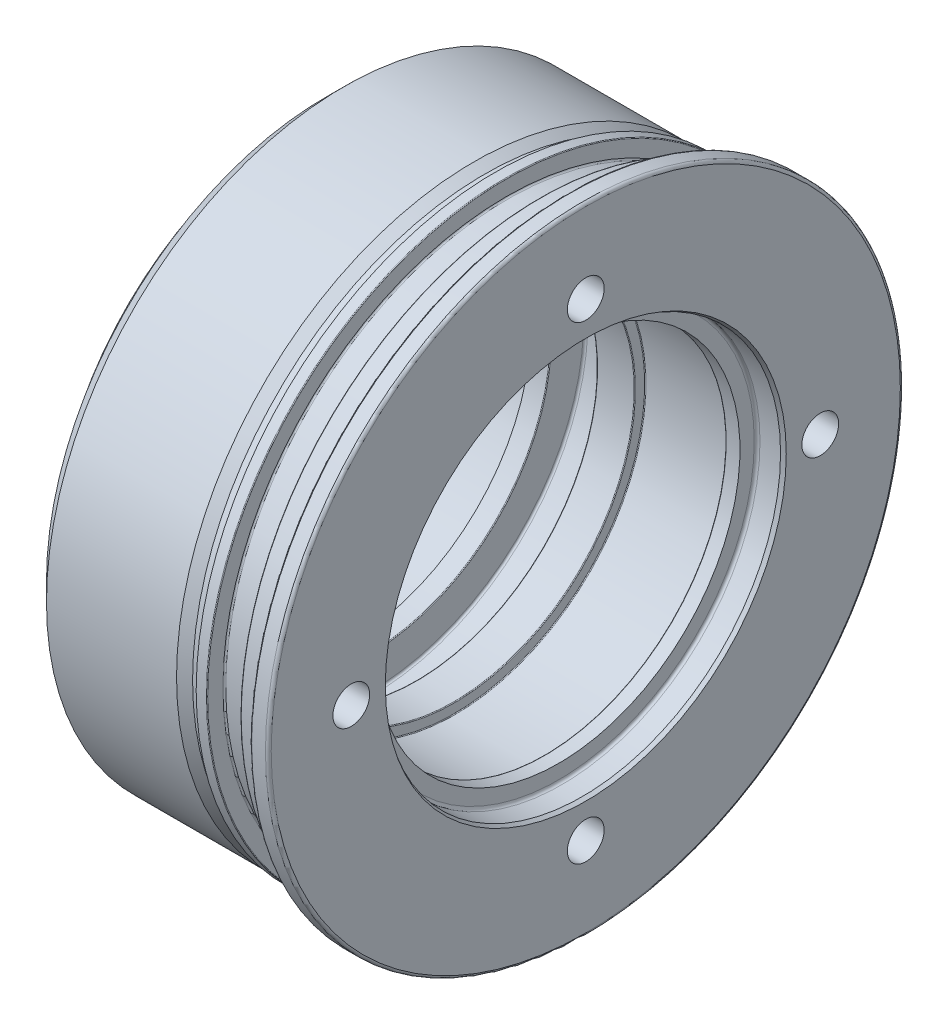
ISO-10303-21;
HEADER;
FILE_DESCRIPTION(('STEP AP214'),'2;1');
FILE_NAME('part.step','',(''),(''),'','','');
FILE_SCHEMA(('AUTOMOTIVE_DESIGN { 1 0 10303 214 1 1 1 1 }'));
ENDSEC;
DATA;
#1=APPLICATION_CONTEXT('core data for automotive mechanical design processes');
#2=APPLICATION_PROTOCOL_DEFINITION('international standard','automotive_design',2000,#1);
#3=PRODUCT_CONTEXT('',#1,'mechanical');
#4=PRODUCT('Part','Part','',(#3));
#5=PRODUCT_RELATED_PRODUCT_CATEGORY('part','',(#4));
#6=PRODUCT_DEFINITION_FORMATION('','',#4);
#7=PRODUCT_DEFINITION_CONTEXT('part definition',#1,'design');
#8=PRODUCT_DEFINITION('design','',#6,#7);
#9=PRODUCT_DEFINITION_SHAPE('','',#8);
#10=(LENGTH_UNIT() NAMED_UNIT(*) SI_UNIT(.MILLI.,.METRE.));
#11=(NAMED_UNIT(*) PLANE_ANGLE_UNIT() SI_UNIT($,.RADIAN.));
#12=(NAMED_UNIT(*) SI_UNIT($,.STERADIAN.) SOLID_ANGLE_UNIT());
#13=UNCERTAINTY_MEASURE_WITH_UNIT(LENGTH_MEASURE(1.E-05),#10,'distance_accuracy_value','');
#14=(GEOMETRIC_REPRESENTATION_CONTEXT(3) GLOBAL_UNCERTAINTY_ASSIGNED_CONTEXT((#13)) GLOBAL_UNIT_ASSIGNED_CONTEXT((#10,
#11,#12)) REPRESENTATION_CONTEXT('',''));
#15=CARTESIAN_POINT('',(0.,0.,0.));
#16=DIRECTION('',(0.,0.,1.));
#17=DIRECTION('',(1.,0.,0.));
#18=AXIS2_PLACEMENT_3D('',#15,#16,#17);
#19=CARTESIAN_POINT('',(-77.4999999999995,0.,0.));
#20=DIRECTION('',(-1.,0.,0.));
#21=DIRECTION('',(0.,0.,0.999999999999999));
#22=AXIS2_PLACEMENT_3D('',#19,#20,#21);
#23=CYLINDRICAL_SURFACE('',#22,81.);
#24=CARTESIAN_POINT('',(-27.9999999999994,-1.11022302462516E-13,-1.66533453693773E-13));
#25=DIRECTION('',(-1.,0.,0.));
#26=DIRECTION('',(0.,0.,0.999999999999999));
#27=AXIS2_PLACEMENT_3D('',#24,#25,#26);
#28=CIRCLE('',#27,81.);
#29=CARTESIAN_POINT('',(-27.9999999999994,-1.11022302462516E-13,80.9999999999998));
#30=VERTEX_POINT('',#29);
#31=EDGE_CURVE('E11',#30,#30,#28,.T.);
#32=ORIENTED_EDGE('',*,*,#31,.F.);
#33=EDGE_LOOP('',(#32));
#34=FACE_BOUND('',#33,.T.);
#35=CARTESIAN_POINT('',(-24.9999999999995,0.,0.));
#36=DIRECTION('',(-1.,0.,0.));
#37=DIRECTION('',(0.,0.,0.999999999999999));
#38=AXIS2_PLACEMENT_3D('',#35,#36,#37);
#39=CIRCLE('',#38,81.);
#40=CARTESIAN_POINT('',(-24.9999999999995,0.,80.9999999999999));
#41=VERTEX_POINT('',#40);
#42=EDGE_CURVE('E98',#41,#41,#39,.T.);
#43=ORIENTED_EDGE('',*,*,#42,.T.);
#44=EDGE_LOOP('',(#43));
#45=FACE_BOUND('',#44,.T.);
#46=ADVANCED_FACE('F45',(#34,#45),#23,.T.);
#47=CARTESIAN_POINT('',(-27.9999999999994,-1.11022302462516E-13,-1.66533453693773E-13));
#48=DIRECTION('',(-1.,0.,0.));
#49=DIRECTION('',(0.,0.,0.999999999999999));
#50=AXIS2_PLACEMENT_3D('',#47,#48,#49);
#51=CONICAL_SURFACE('',#50,81.,0.47123889803847);
#52=CARTESIAN_POINT('',(-30.9439157582572,0.,-1.11022302462516E-13));
#53=DIRECTION('',(-1.,0.,0.));
#54=DIRECTION('',(0.,0.,0.999999999999999));
#55=AXIS2_PLACEMENT_3D('',#52,#53,#54);
#56=CIRCLE('',#55,82.5);
#57=CARTESIAN_POINT('',(-30.9439157582572,0.,82.4999999999998));
#58=VERTEX_POINT('',#57);
#59=EDGE_CURVE('E52',#58,#58,#56,.T.);
#60=ORIENTED_EDGE('',*,*,#59,.F.);
#61=EDGE_LOOP('',(#60));
#62=FACE_BOUND('',#61,.T.);
#63=ORIENTED_EDGE('',*,*,#31,.T.);
#64=EDGE_LOOP('',(#63));
#65=FACE_BOUND('',#64,.T.);
#66=ADVANCED_FACE('F234',(#62,#65),#51,.T.);
#67=CARTESIAN_POINT('',(-77.4999999999995,0.,0.));
#68=DIRECTION('',(-1.,0.,0.));
#69=DIRECTION('',(0.,0.,0.999999999999999));
#70=AXIS2_PLACEMENT_3D('',#67,#68,#69);
#71=CYLINDRICAL_SURFACE('',#70,82.5);
#72=CARTESIAN_POINT('',(-66.9999999999999,0.,0.));
#73=DIRECTION('',(-1.,0.,0.));
#74=DIRECTION('',(0.,0.,0.999999999999999));
#75=AXIS2_PLACEMENT_3D('',#72,#73,#74);
#76=CIRCLE('',#75,82.5);
#77=CARTESIAN_POINT('',(-66.9999999999999,0.,82.4999999999999));
#78=VERTEX_POINT('',#77);
#79=EDGE_CURVE('E227',#78,#78,#76,.T.);
#80=ORIENTED_EDGE('',*,*,#79,.F.);
#81=EDGE_LOOP('',(#80));
#82=FACE_BOUND('',#81,.T.);
#83=ORIENTED_EDGE('',*,*,#59,.T.);
#84=EDGE_LOOP('',(#83));
#85=FACE_BOUND('',#84,.T.);
#86=ADVANCED_FACE('F232',(#82,#85),#71,.T.);
#87=CARTESIAN_POINT('',(-71.9999999999998,0.,0.));
#88=DIRECTION('',(1.,0.,0.));
#89=DIRECTION('',(0.,0.,-0.999999999999999));
#90=AXIS2_PLACEMENT_3D('',#87,#88,#89);
#91=CONICAL_SURFACE('',#90,77.5,0.785398163397444);
#92=ORIENTED_EDGE('',*,*,#79,.T.);
#93=EDGE_LOOP('',(#92));
#94=FACE_BOUND('',#93,.T.);
#95=CARTESIAN_POINT('',(-71.9999999999998,0.,0.));
#96=DIRECTION('',(-1.,0.,0.));
#97=DIRECTION('',(0.,0.,0.999999999999999));
#98=AXIS2_PLACEMENT_3D('',#95,#96,#97);
#99=CIRCLE('',#98,77.5);
#100=CARTESIAN_POINT('',(-71.9999999999998,0.,77.4999999999999));
#101=VERTEX_POINT('',#100);
#102=EDGE_CURVE('E224',#101,#101,#99,.T.);
#103=ORIENTED_EDGE('',*,*,#102,.F.);
#104=EDGE_LOOP('',(#103));
#105=FACE_BOUND('',#104,.T.);
#106=ADVANCED_FACE('F432',(#94,#105),#91,.T.);
#107=CARTESIAN_POINT('',(-72.0000000000001,70.,0.));
#108=DIRECTION('',(-1.,0.,0.));
#109=DIRECTION('',(0.,0.,0.999999999999999));
#110=AXIS2_PLACEMENT_3D('',#107,#108,#109);
#111=PLANE('',#110);
#112=ORIENTED_EDGE('',*,*,#102,.T.);
#113=EDGE_LOOP('',(#112));
#114=FACE_BOUND('',#113,.T.);
#115=CARTESIAN_POINT('',(-71.9999999999998,0.,0.));
#116=DIRECTION('',(-1.,0.,0.));
#117=DIRECTION('',(0.,0.,0.999999999999999));
#118=AXIS2_PLACEMENT_3D('',#115,#116,#117);
#119=CIRCLE('',#118,70.);
#120=CARTESIAN_POINT('',(-71.9999999999998,0.,70.));
#121=VERTEX_POINT('',#120);
#122=EDGE_CURVE('E221',#121,#121,#119,.T.);
#123=ORIENTED_EDGE('',*,*,#122,.F.);
#124=EDGE_LOOP('',(#123));
#125=FACE_BOUND('',#124,.T.);
#126=ADVANCED_FACE('F428',(#114,#125),#111,.T.);
#127=CARTESIAN_POINT('',(-77.4999999999995,0.,0.));
#128=DIRECTION('',(-1.,0.,0.));
#129=DIRECTION('',(0.,0.,0.999999999999999));
#130=AXIS2_PLACEMENT_3D('',#127,#128,#129);
#131=CYLINDRICAL_SURFACE('',#130,70.);
#132=ORIENTED_EDGE('',*,*,#122,.T.);
#133=EDGE_LOOP('',(#132));
#134=FACE_BOUND('',#133,.T.);
#135=CARTESIAN_POINT('',(-77.4999999999995,0.,0.));
#136=DIRECTION('',(-1.,0.,0.));
#137=DIRECTION('',(0.,0.,0.999999999999999));
#138=AXIS2_PLACEMENT_3D('',#135,#136,#137);
#139=CIRCLE('',#138,70.);
#140=CARTESIAN_POINT('',(-77.4999999999995,0.,70.));
#141=VERTEX_POINT('',#140);
#142=EDGE_CURVE('E218',#141,#141,#139,.T.);
#143=ORIENTED_EDGE('',*,*,#142,.F.);
#144=EDGE_LOOP('',(#143));
#145=FACE_BOUND('',#144,.T.);
#146=ADVANCED_FACE('F424',(#134,#145),#131,.T.);
#147=CARTESIAN_POINT('',(-77.5000000000006,70.0000000000001,0.));
#148=DIRECTION('',(1.,0.,0.));
#149=DIRECTION('',(0.,0.,-0.999999999999999));
#150=AXIS2_PLACEMENT_3D('',#147,#148,#149);
#151=PLANE('',#150);
#152=CARTESIAN_POINT('',(-77.4999999999995,0.,0.));
#153=DIRECTION('',(-1.,0.,0.));
#154=DIRECTION('',(0.,0.,0.999999999999999));
#155=AXIS2_PLACEMENT_3D('',#152,#153,#154);
#156=CIRCLE('',#155,52.);
#157=CARTESIAN_POINT('',(-77.4999999999995,0.,52.));
#158=VERTEX_POINT('',#157);
#159=EDGE_CURVE('E215',#158,#158,#156,.T.);
#160=ORIENTED_EDGE('',*,*,#159,.F.);
#161=EDGE_LOOP('',(#160));
#162=FACE_BOUND('',#161,.T.);
#163=ORIENTED_EDGE('',*,*,#142,.T.);
#164=EDGE_LOOP('',(#163));
#165=FACE_BOUND('',#164,.T.);
#166=ADVANCED_FACE('F420',(#162,#165),#151,.F.);
#167=CARTESIAN_POINT('',(-77.4999999999995,0.,0.));
#168=DIRECTION('',(-1.,0.,0.));
#169=DIRECTION('',(0.,0.,0.999999999999999));
#170=AXIS2_PLACEMENT_3D('',#167,#168,#169);
#171=CYLINDRICAL_SURFACE('',#170,52.);
#172=CARTESIAN_POINT('',(-65.4999999999994,0.,-1.11022302462516E-13));
#173=DIRECTION('',(-1.,0.,0.));
#174=DIRECTION('',(0.,0.,0.999999999999999));
#175=AXIS2_PLACEMENT_3D('',#172,#173,#174);
#176=CIRCLE('',#175,52.);
#177=CARTESIAN_POINT('',(-65.4999999999994,0.,51.9999999999999));
#178=VERTEX_POINT('',#177);
#179=EDGE_CURVE('E212',#178,#178,#176,.T.);
#180=ORIENTED_EDGE('',*,*,#179,.F.);
#181=EDGE_LOOP('',(#180));
#182=FACE_BOUND('',#181,.T.);
#183=ORIENTED_EDGE('',*,*,#159,.T.);
#184=EDGE_LOOP('',(#183));
#185=FACE_BOUND('',#184,.T.);
#186=ADVANCED_FACE('F416',(#182,#185),#171,.F.);
#187=CARTESIAN_POINT('',(-65.4999999999994,52.,0.));
#188=DIRECTION('',(1.,0.,0.));
#189=DIRECTION('',(0.,0.,-0.999999999999999));
#190=AXIS2_PLACEMENT_3D('',#187,#188,#189);
#191=PLANE('',#190);
#192=CARTESIAN_POINT('',(-65.4999999999994,0.,-1.11022302462516E-13));
#193=DIRECTION('',(-1.,0.,0.));
#194=DIRECTION('',(0.,0.,0.999999999999999));
#195=AXIS2_PLACEMENT_3D('',#192,#193,#194);
#196=CIRCLE('',#195,50.25);
#197=CARTESIAN_POINT('',(-65.4999999999994,0.,50.2499999999999));
#198=VERTEX_POINT('',#197);
#199=EDGE_CURVE('E209',#198,#198,#196,.T.);
#200=ORIENTED_EDGE('',*,*,#199,.F.);
#201=EDGE_LOOP('',(#200));
#202=FACE_BOUND('',#201,.T.);
#203=ORIENTED_EDGE('',*,*,#179,.T.);
#204=EDGE_LOOP('',(#203));
#205=FACE_BOUND('',#204,.T.);
#206=ADVANCED_FACE('F412',(#202,#205),#191,.F.);
#207=CARTESIAN_POINT('',(-77.4999999999995,0.,0.));
#208=DIRECTION('',(-1.,0.,0.));
#209=DIRECTION('',(0.,0.,0.999999999999999));
#210=AXIS2_PLACEMENT_3D('',#207,#208,#209);
#211=CYLINDRICAL_SURFACE('',#210,50.25);
#212=CARTESIAN_POINT('',(-60.2,0.,-1.11022302462516E-13));
#213=DIRECTION('',(-1.,0.,0.));
#214=DIRECTION('',(0.,0.,0.999999999999999));
#215=AXIS2_PLACEMENT_3D('',#212,#213,#214);
#216=CIRCLE('',#215,50.25);
#217=CARTESIAN_POINT('',(-60.2,0.,50.2499999999999));
#218=VERTEX_POINT('',#217);
#219=EDGE_CURVE('E206',#218,#218,#216,.T.);
#220=ORIENTED_EDGE('',*,*,#219,.F.);
#221=EDGE_LOOP('',(#220));
#222=FACE_BOUND('',#221,.T.);
#223=ORIENTED_EDGE('',*,*,#199,.T.);
#224=EDGE_LOOP('',(#223));
#225=FACE_BOUND('',#224,.T.);
#226=ADVANCED_FACE('F408',(#222,#225),#211,.F.);
#227=CARTESIAN_POINT('',(-60.2,0.,-1.11022302462516E-13));
#228=DIRECTION('',(-1.,0.,0.));
#229=DIRECTION('',(0.,0.,0.999999999999999));
#230=AXIS2_PLACEMENT_3D('',#227,#228,#229);
#231=TOROIDAL_SURFACE('',#230,50.45,0.199999999999995);
#232=CARTESIAN_POINT('',(-59.9999999999998,0.,-1.11022302462516E-13));
#233=DIRECTION('',(-1.,0.,0.));
#234=DIRECTION('',(0.,0.,0.999999999999999));
#235=AXIS2_PLACEMENT_3D('',#232,#233,#234);
#236=CIRCLE('',#235,50.45);
#237=CARTESIAN_POINT('',(-59.9999999999998,0.,50.4499999999999));
#238=VERTEX_POINT('',#237);
#239=EDGE_CURVE('E203',#238,#238,#236,.T.);
#240=ORIENTED_EDGE('',*,*,#239,.F.);
#241=EDGE_LOOP('',(#240));
#242=FACE_BOUND('',#241,.T.);
#243=ORIENTED_EDGE('',*,*,#219,.T.);
#244=EDGE_LOOP('',(#243));
#245=FACE_BOUND('',#244,.T.);
#246=ADVANCED_FACE('F404',(#242,#245),#231,.T.);
#247=CARTESIAN_POINT('',(-60.0000000000005,50.45,0.));
#248=DIRECTION('',(-1.,0.,0.));
#249=DIRECTION('',(0.,0.,0.999999999999999));
#250=AXIS2_PLACEMENT_3D('',#247,#248,#249);
#251=PLANE('',#250);
#252=CARTESIAN_POINT('',(-59.9999999999998,0.,-1.11022302462516E-13));
#253=DIRECTION('',(-1.,0.,0.));
#254=DIRECTION('',(0.,0.,0.999999999999999));
#255=AXIS2_PLACEMENT_3D('',#252,#253,#254);
#256=CIRCLE('',#255,59.4);
#257=CARTESIAN_POINT('',(-59.9999999999998,0.,59.3999999999998));
#258=VERTEX_POINT('',#257);
#259=EDGE_CURVE('E200',#258,#258,#256,.T.);
#260=ORIENTED_EDGE('',*,*,#259,.F.);
#261=EDGE_LOOP('',(#260));
#262=FACE_BOUND('',#261,.T.);
#263=ORIENTED_EDGE('',*,*,#239,.T.);
#264=EDGE_LOOP('',(#263));
#265=FACE_BOUND('',#264,.T.);
#266=ADVANCED_FACE('F400',(#262,#265),#251,.F.);
#267=CARTESIAN_POINT('',(-59.4000000000006,0.,0.));
#268=DIRECTION('',(-1.,0.,0.));
#269=DIRECTION('',(0.,0.,0.999999999999999));
#270=AXIS2_PLACEMENT_3D('',#267,#268,#269);
#271=TOROIDAL_SURFACE('',#270,59.4,0.600000000000003);
#272=CARTESIAN_POINT('',(-59.4000000000006,0.,0.));
#273=DIRECTION('',(-1.,0.,0.));
#274=DIRECTION('',(0.,0.,0.999999999999999));
#275=AXIS2_PLACEMENT_3D('',#272,#273,#274);
#276=CIRCLE('',#275,60.);
#277=CARTESIAN_POINT('',(-59.4000000000006,0.,60.));
#278=VERTEX_POINT('',#277);
#279=EDGE_CURVE('E197',#278,#278,#276,.T.);
#280=ORIENTED_EDGE('',*,*,#279,.F.);
#281=EDGE_LOOP('',(#280));
#282=FACE_BOUND('',#281,.T.);
#283=ORIENTED_EDGE('',*,*,#259,.T.);
#284=EDGE_LOOP('',(#283));
#285=FACE_BOUND('',#284,.T.);
#286=ADVANCED_FACE('F396',(#282,#285),#271,.F.);
#287=CARTESIAN_POINT('',(-77.4999999999995,0.,0.));
#288=DIRECTION('',(-1.,0.,0.));
#289=DIRECTION('',(0.,0.,0.999999999999999));
#290=AXIS2_PLACEMENT_3D('',#287,#288,#289);
#291=CYLINDRICAL_SURFACE('',#290,60.);
#292=CARTESIAN_POINT('',(-47.5999999999994,0.,-1.11022302462516E-13));
#293=DIRECTION('',(-1.,0.,0.));
#294=DIRECTION('',(0.,0.,0.999999999999999));
#295=AXIS2_PLACEMENT_3D('',#292,#293,#294);
#296=CIRCLE('',#295,60.);
#297=CARTESIAN_POINT('',(-47.5999999999994,0.,59.9999999999998));
#298=VERTEX_POINT('',#297);
#299=EDGE_CURVE('E194',#298,#298,#296,.T.);
#300=ORIENTED_EDGE('',*,*,#299,.F.);
#301=EDGE_LOOP('',(#300));
#302=FACE_BOUND('',#301,.T.);
#303=ORIENTED_EDGE('',*,*,#279,.T.);
#304=EDGE_LOOP('',(#303));
#305=FACE_BOUND('',#304,.T.);
#306=ADVANCED_FACE('F392',(#302,#305),#291,.F.);
#307=CARTESIAN_POINT('',(-47.5999999999994,0.,-1.11022302462516E-13));
#308=DIRECTION('',(-1.,0.,0.));
#309=DIRECTION('',(0.,0.,0.999999999999999));
#310=AXIS2_PLACEMENT_3D('',#307,#308,#309);
#311=TOROIDAL_SURFACE('',#310,59.4,0.600000000000003);
#312=CARTESIAN_POINT('',(-46.9999999999993,0.,0.));
#313=DIRECTION('',(-1.,0.,0.));
#314=DIRECTION('',(0.,0.,0.999999999999999));
#315=AXIS2_PLACEMENT_3D('',#312,#313,#314);
#316=CIRCLE('',#315,59.4);
#317=CARTESIAN_POINT('',(-46.9999999999993,0.,59.4));
#318=VERTEX_POINT('',#317);
#319=EDGE_CURVE('E191',#318,#318,#316,.T.);
#320=ORIENTED_EDGE('',*,*,#319,.F.);
#321=EDGE_LOOP('',(#320));
#322=FACE_BOUND('',#321,.T.);
#323=ORIENTED_EDGE('',*,*,#299,.T.);
#324=EDGE_LOOP('',(#323));
#325=FACE_BOUND('',#324,.T.);
#326=ADVANCED_FACE('F388',(#322,#325),#311,.F.);
#327=CARTESIAN_POINT('',(-47.0000000000006,59.4,0.));
#328=DIRECTION('',(1.,0.,0.));
#329=DIRECTION('',(0.,0.,-0.999999999999999));
#330=AXIS2_PLACEMENT_3D('',#327,#328,#329);
#331=PLANE('',#330);
#332=CARTESIAN_POINT('',(-46.9999999999993,0.,0.));
#333=DIRECTION('',(-1.,0.,0.));
#334=DIRECTION('',(0.,0.,0.999999999999999));
#335=AXIS2_PLACEMENT_3D('',#332,#333,#334);
#336=CIRCLE('',#335,50.3);
#337=CARTESIAN_POINT('',(-46.9999999999993,0.,50.3));
#338=VERTEX_POINT('',#337);
#339=EDGE_CURVE('E188',#338,#338,#336,.T.);
#340=ORIENTED_EDGE('',*,*,#339,.F.);
#341=EDGE_LOOP('',(#340));
#342=FACE_BOUND('',#341,.T.);
#343=ORIENTED_EDGE('',*,*,#319,.T.);
#344=EDGE_LOOP('',(#343));
#345=FACE_BOUND('',#344,.T.);
#346=ADVANCED_FACE('F384',(#342,#345),#331,.F.);
#347=CARTESIAN_POINT('',(-46.7999999999995,0.,0.));
#348=DIRECTION('',(-1.,0.,0.));
#349=DIRECTION('',(0.,0.,0.999999999999999));
#350=AXIS2_PLACEMENT_3D('',#347,#348,#349);
#351=TOROIDAL_SURFACE('',#350,50.3,0.200000000000002);
#352=CARTESIAN_POINT('',(-46.7999999999995,0.,0.));
#353=DIRECTION('',(-1.,0.,0.));
#354=DIRECTION('',(0.,0.,0.999999999999999));
#355=AXIS2_PLACEMENT_3D('',#352,#353,#354);
#356=CIRCLE('',#355,50.1);
#357=CARTESIAN_POINT('',(-46.7999999999995,0.,50.0999999999999));
#358=VERTEX_POINT('',#357);
#359=EDGE_CURVE('E185',#358,#358,#356,.T.);
#360=ORIENTED_EDGE('',*,*,#359,.F.);
#361=EDGE_LOOP('',(#360));
#362=FACE_BOUND('',#361,.T.);
#363=ORIENTED_EDGE('',*,*,#339,.T.);
#364=EDGE_LOOP('',(#363));
#365=FACE_BOUND('',#364,.T.);
#366=ADVANCED_FACE('F380',(#362,#365),#351,.T.);
#367=CARTESIAN_POINT('',(-77.4999999999995,0.,0.));
#368=DIRECTION('',(-1.,0.,0.));
#369=DIRECTION('',(0.,0.,0.999999999999999));
#370=AXIS2_PLACEMENT_3D('',#367,#368,#369);
#371=CYLINDRICAL_SURFACE('',#370,50.1);
#372=CARTESIAN_POINT('',(-36.7,-1.11022302462516E-13,-1.11022302462516E-13));
#373=DIRECTION('',(-1.,0.,0.));
#374=DIRECTION('',(0.,0.,0.999999999999999));
#375=AXIS2_PLACEMENT_3D('',#372,#373,#374);
#376=CIRCLE('',#375,50.1);
#377=CARTESIAN_POINT('',(-36.7,-1.11022302462516E-13,50.0999999999998));
#378=VERTEX_POINT('',#377);
#379=EDGE_CURVE('E182',#378,#378,#376,.T.);
#380=ORIENTED_EDGE('',*,*,#379,.F.);
#381=EDGE_LOOP('',(#380));
#382=FACE_BOUND('',#381,.T.);
#383=ORIENTED_EDGE('',*,*,#359,.T.);
#384=EDGE_LOOP('',(#383));
#385=FACE_BOUND('',#384,.T.);
#386=ADVANCED_FACE('F376',(#382,#385),#371,.F.);
#387=CARTESIAN_POINT('',(-36.7,-1.11022302462516E-13,-1.11022302462516E-13));
#388=DIRECTION('',(-1.,0.,0.));
#389=DIRECTION('',(0.,0.,0.999999999999999));
#390=AXIS2_PLACEMENT_3D('',#387,#388,#389);
#391=TOROIDAL_SURFACE('',#390,50.3,0.200000000000002);
#392=CARTESIAN_POINT('',(-36.5,0.,0.));
#393=DIRECTION('',(-1.,0.,0.));
#394=DIRECTION('',(0.,0.,0.999999999999999));
#395=AXIS2_PLACEMENT_3D('',#392,#393,#394);
#396=CIRCLE('',#395,50.3);
#397=CARTESIAN_POINT('',(-36.5,0.,50.3));
#398=VERTEX_POINT('',#397);
#399=EDGE_CURVE('E179',#398,#398,#396,.T.);
#400=ORIENTED_EDGE('',*,*,#399,.F.);
#401=EDGE_LOOP('',(#400));
#402=FACE_BOUND('',#401,.T.);
#403=ORIENTED_EDGE('',*,*,#379,.T.);
#404=EDGE_LOOP('',(#403));
#405=FACE_BOUND('',#404,.T.);
#406=ADVANCED_FACE('F372',(#402,#405),#391,.T.);
#407=CARTESIAN_POINT('',(-36.5,50.3000000000001,-1.11022302462516E-13));
#408=DIRECTION('',(-1.,0.,0.));
#409=DIRECTION('',(0.,0.,0.999999999999999));
#410=AXIS2_PLACEMENT_3D('',#407,#408,#409);
#411=PLANE('',#410);
#412=CARTESIAN_POINT('',(-36.5,0.,0.));
#413=DIRECTION('',(-1.,0.,0.));
#414=DIRECTION('',(0.,0.,0.999999999999999));
#415=AXIS2_PLACEMENT_3D('',#412,#413,#414);
#416=CIRCLE('',#415,52.8);
#417=CARTESIAN_POINT('',(-36.5,0.,52.8));
#418=VERTEX_POINT('',#417);
#419=EDGE_CURVE('E176',#418,#418,#416,.T.);
#420=ORIENTED_EDGE('',*,*,#419,.F.);
#421=EDGE_LOOP('',(#420));
#422=FACE_BOUND('',#421,.T.);
#423=ORIENTED_EDGE('',*,*,#399,.T.);
#424=EDGE_LOOP('',(#423));
#425=FACE_BOUND('',#424,.T.);
#426=ADVANCED_FACE('F368',(#422,#425),#411,.F.);
#427=CARTESIAN_POINT('',(-36.3,0.,0.));
#428=DIRECTION('',(-1.,0.,0.));
#429=DIRECTION('',(0.,0.,0.999999999999999));
#430=AXIS2_PLACEMENT_3D('',#427,#428,#429);
#431=TOROIDAL_SURFACE('',#430,52.8,0.199999999999999);
#432=CARTESIAN_POINT('',(-36.3,0.,0.));
#433=DIRECTION('',(-1.,0.,0.));
#434=DIRECTION('',(0.,0.,0.999999999999999));
#435=AXIS2_PLACEMENT_3D('',#432,#433,#434);
#436=CIRCLE('',#435,53.);
#437=CARTESIAN_POINT('',(-36.3,0.,53.));
#438=VERTEX_POINT('',#437);
#439=EDGE_CURVE('E173',#438,#438,#436,.T.);
#440=ORIENTED_EDGE('',*,*,#439,.F.);
#441=EDGE_LOOP('',(#440));
#442=FACE_BOUND('',#441,.T.);
#443=ORIENTED_EDGE('',*,*,#419,.T.);
#444=EDGE_LOOP('',(#443));
#445=FACE_BOUND('',#444,.T.);
#446=ADVANCED_FACE('F364',(#442,#445),#431,.F.);
#447=CARTESIAN_POINT('',(-77.4999999999995,0.,0.));
#448=DIRECTION('',(-1.,0.,0.));
#449=DIRECTION('',(0.,0.,0.999999999999999));
#450=AXIS2_PLACEMENT_3D('',#447,#448,#449);
#451=CYLINDRICAL_SURFACE('',#450,53.);
#452=CARTESIAN_POINT('',(-11.7,-1.11022302462516E-13,0.));
#453=DIRECTION('',(-1.,0.,0.));
#454=DIRECTION('',(0.,0.,0.999999999999999));
#455=AXIS2_PLACEMENT_3D('',#452,#453,#454);
#456=CIRCLE('',#455,53.);
#457=CARTESIAN_POINT('',(-11.7,-1.11022302462516E-13,53.));
#458=VERTEX_POINT('',#457);
#459=EDGE_CURVE('E170',#458,#458,#456,.T.);
#460=ORIENTED_EDGE('',*,*,#459,.F.);
#461=EDGE_LOOP('',(#460));
#462=FACE_BOUND('',#461,.T.);
#463=ORIENTED_EDGE('',*,*,#439,.T.);
#464=EDGE_LOOP('',(#463));
#465=FACE_BOUND('',#464,.T.);
#466=ADVANCED_FACE('F360',(#462,#465),#451,.F.);
#467=CARTESIAN_POINT('',(-11.7,-1.11022302462516E-13,0.));
#468=DIRECTION('',(-1.,0.,0.));
#469=DIRECTION('',(0.,0.,0.999999999999999));
#470=AXIS2_PLACEMENT_3D('',#467,#468,#469);
#471=TOROIDAL_SURFACE('',#470,52.8,0.2);
#472=CARTESIAN_POINT('',(-11.4999999999994,0.,0.));
#473=DIRECTION('',(-1.,0.,0.));
#474=DIRECTION('',(0.,0.,0.999999999999999));
#475=AXIS2_PLACEMENT_3D('',#472,#473,#474);
#476=CIRCLE('',#475,52.8);
#477=CARTESIAN_POINT('',(-11.4999999999994,0.,52.8));
#478=VERTEX_POINT('',#477);
#479=EDGE_CURVE('E167',#478,#478,#476,.T.);
#480=ORIENTED_EDGE('',*,*,#479,.F.);
#481=EDGE_LOOP('',(#480));
#482=FACE_BOUND('',#481,.T.);
#483=ORIENTED_EDGE('',*,*,#459,.T.);
#484=EDGE_LOOP('',(#483));
#485=FACE_BOUND('',#484,.T.);
#486=ADVANCED_FACE('F356',(#482,#485),#471,.F.);
#487=CARTESIAN_POINT('',(-11.5000000000005,52.7999999999999,-1.11022302462516E-13));
#488=DIRECTION('',(1.,0.,0.));
#489=DIRECTION('',(0.,0.,-0.999999999999999));
#490=AXIS2_PLACEMENT_3D('',#487,#488,#489);
#491=PLANE('',#490);
#492=CARTESIAN_POINT('',(-11.4999999999994,0.,0.));
#493=DIRECTION('',(-1.,0.,0.));
#494=DIRECTION('',(0.,0.,0.999999999999999));
#495=AXIS2_PLACEMENT_3D('',#492,#493,#494);
#496=CIRCLE('',#495,50.45);
#497=CARTESIAN_POINT('',(-11.4999999999994,0.,50.45));
#498=VERTEX_POINT('',#497);
#499=EDGE_CURVE('E164',#498,#498,#496,.T.);
#500=ORIENTED_EDGE('',*,*,#499,.F.);
#501=EDGE_LOOP('',(#500));
#502=FACE_BOUND('',#501,.T.);
#503=ORIENTED_EDGE('',*,*,#479,.T.);
#504=EDGE_LOOP('',(#503));
#505=FACE_BOUND('',#504,.T.);
#506=ADVANCED_FACE('F352',(#502,#505),#491,.F.);
#507=CARTESIAN_POINT('',(-11.2999999999994,0.,-1.11022302462516E-13));
#508=DIRECTION('',(-1.,0.,0.));
#509=DIRECTION('',(0.,0.,0.999999999999999));
#510=AXIS2_PLACEMENT_3D('',#507,#508,#509);
#511=TOROIDAL_SURFACE('',#510,50.45,0.2);
#512=CARTESIAN_POINT('',(-11.2999999999994,0.,-1.11022302462516E-13));
#513=DIRECTION('',(-1.,0.,0.));
#514=DIRECTION('',(0.,0.,0.999999999999999));
#515=AXIS2_PLACEMENT_3D('',#512,#513,#514);
#516=CIRCLE('',#515,50.25);
#517=CARTESIAN_POINT('',(-11.2999999999994,0.,50.2499999999999));
#518=VERTEX_POINT('',#517);
#519=EDGE_CURVE('E161',#518,#518,#516,.T.);
#520=ORIENTED_EDGE('',*,*,#519,.F.);
#521=EDGE_LOOP('',(#520));
#522=FACE_BOUND('',#521,.T.);
#523=ORIENTED_EDGE('',*,*,#499,.T.);
#524=EDGE_LOOP('',(#523));
#525=FACE_BOUND('',#524,.T.);
#526=ADVANCED_FACE('F348',(#522,#525),#511,.T.);
#527=CARTESIAN_POINT('',(-77.4999999999995,0.,0.));
#528=DIRECTION('',(-1.,0.,0.));
#529=DIRECTION('',(0.,0.,0.999999999999999));
#530=AXIS2_PLACEMENT_3D('',#527,#528,#529);
#531=CYLINDRICAL_SURFACE('',#530,50.25);
#532=CARTESIAN_POINT('',(-7.4999999999994,0.,0.));
#533=DIRECTION('',(-1.,0.,0.));
#534=DIRECTION('',(0.,0.,0.999999999999999));
#535=AXIS2_PLACEMENT_3D('',#532,#533,#534);
#536=CIRCLE('',#535,50.25);
#537=CARTESIAN_POINT('',(-7.4999999999994,0.,50.2499999999999));
#538=VERTEX_POINT('',#537);
#539=EDGE_CURVE('E158',#538,#538,#536,.T.);
#540=ORIENTED_EDGE('',*,*,#539,.F.);
#541=EDGE_LOOP('',(#540));
#542=FACE_BOUND('',#541,.T.);
#543=ORIENTED_EDGE('',*,*,#519,.T.);
#544=EDGE_LOOP('',(#543));
#545=FACE_BOUND('',#544,.T.);
#546=ADVANCED_FACE('F344',(#542,#545),#531,.F.);
#547=CARTESIAN_POINT('',(-7.50000000000051,50.25,0.));
#548=DIRECTION('',(-1.,0.,0.));
#549=DIRECTION('',(0.,0.,0.999999999999999));
#550=AXIS2_PLACEMENT_3D('',#547,#548,#549);
#551=PLANE('',#550);
#552=CARTESIAN_POINT('',(-7.4999999999994,0.,0.));
#553=DIRECTION('',(-1.,0.,0.));
#554=DIRECTION('',(0.,0.,0.999999999999999));
#555=AXIS2_PLACEMENT_3D('',#552,#553,#554);
#556=CIRCLE('',#555,54.2);
#557=CARTESIAN_POINT('',(-7.4999999999994,0.,54.1999999999999));
#558=VERTEX_POINT('',#557);
#559=EDGE_CURVE('E155',#558,#558,#556,.T.);
#560=ORIENTED_EDGE('',*,*,#559,.F.);
#561=EDGE_LOOP('',(#560));
#562=FACE_BOUND('',#561,.T.);
#563=ORIENTED_EDGE('',*,*,#539,.T.);
#564=EDGE_LOOP('',(#563));
#565=FACE_BOUND('',#564,.T.);
#566=ADVANCED_FACE('F340',(#562,#565),#551,.F.);
#567=CARTESIAN_POINT('',(-6.69999999999993,0.,0.));
#568=DIRECTION('',(-1.,0.,0.));
#569=DIRECTION('',(0.,0.,0.999999999999999));
#570=AXIS2_PLACEMENT_3D('',#567,#568,#569);
#571=TOROIDAL_SURFACE('',#570,54.2,0.800000000000001);
#572=CARTESIAN_POINT('',(-6.69999999999993,0.,0.));
#573=DIRECTION('',(-1.,0.,0.));
#574=DIRECTION('',(0.,0.,0.999999999999999));
#575=AXIS2_PLACEMENT_3D('',#572,#573,#574);
#576=CIRCLE('',#575,55.);
#577=CARTESIAN_POINT('',(-6.69999999999993,0.,55.));
#578=VERTEX_POINT('',#577);
#579=EDGE_CURVE('E152',#578,#578,#576,.T.);
#580=ORIENTED_EDGE('',*,*,#579,.F.);
#581=EDGE_LOOP('',(#580));
#582=FACE_BOUND('',#581,.T.);
#583=ORIENTED_EDGE('',*,*,#559,.T.);
#584=EDGE_LOOP('',(#583));
#585=FACE_BOUND('',#584,.T.);
#586=ADVANCED_FACE('F336',(#582,#585),#571,.F.);
#587=CARTESIAN_POINT('',(-77.4999999999995,0.,0.));
#588=DIRECTION('',(-1.,0.,0.));
#589=DIRECTION('',(0.,0.,0.999999999999999));
#590=AXIS2_PLACEMENT_3D('',#587,#588,#589);
#591=CYLINDRICAL_SURFACE('',#590,55.);
#592=CARTESIAN_POINT('',(-0.99999999999989,0.,0.));
#593=DIRECTION('',(-1.,0.,0.));
#594=DIRECTION('',(0.,0.,0.999999999999999));
#595=AXIS2_PLACEMENT_3D('',#592,#593,#594);
#596=CIRCLE('',#595,55.);
#597=CARTESIAN_POINT('',(-0.99999999999989,0.,55.));
#598=VERTEX_POINT('',#597);
#599=EDGE_CURVE('E149',#598,#598,#596,.T.);
#600=ORIENTED_EDGE('',*,*,#599,.F.);
#601=EDGE_LOOP('',(#600));
#602=FACE_BOUND('',#601,.T.);
#603=ORIENTED_EDGE('',*,*,#579,.T.);
#604=EDGE_LOOP('',(#603));
#605=FACE_BOUND('',#604,.T.);
#606=ADVANCED_FACE('F332',(#602,#605),#591,.F.);
#607=CARTESIAN_POINT('',(-0.99999999999989,0.,0.));
#608=DIRECTION('',(1.,0.,0.));
#609=DIRECTION('',(0.,0.,-0.999999999999999));
#610=AXIS2_PLACEMENT_3D('',#607,#608,#609);
#611=CONICAL_SURFACE('',#610,55.,0.523598775598299);
#612=CARTESIAN_POINT('',(0.,0.,0.));
#613=DIRECTION('',(-1.,0.,0.));
#614=DIRECTION('',(0.,0.,0.999999999999999));
#615=AXIS2_PLACEMENT_3D('',#612,#613,#614);
#616=CIRCLE('',#615,55.5773502691896);
#617=CARTESIAN_POINT('',(0.,0.,55.5773502691896));
#618=VERTEX_POINT('',#617);
#619=EDGE_CURVE('E146',#618,#618,#616,.T.);
#620=ORIENTED_EDGE('',*,*,#619,.F.);
#621=EDGE_LOOP('',(#620));
#622=FACE_BOUND('',#621,.T.);
#623=ORIENTED_EDGE('',*,*,#599,.T.);
#624=EDGE_LOOP('',(#623));
#625=FACE_BOUND('',#624,.T.);
#626=ADVANCED_FACE('F328',(#622,#625),#611,.F.);
#627=CARTESIAN_POINT('',(0.,55.5773502691896,-1.11022302462516E-13));
#628=DIRECTION('',(-1.,0.,0.));
#629=DIRECTION('',(0.,0.,0.999999999999999));
#630=AXIS2_PLACEMENT_3D('',#627,#628,#629);
#631=PLANE('',#630);
#632=CARTESIAN_POINT('',(0.,64.9999999999999,-1.66533453693773E-13));
#633=DIRECTION('',(1.,0.,0.));
#634=DIRECTION('',(0.,0.,-0.999999999999999));
#635=AXIS2_PLACEMENT_3D('',#632,#633,#634);
#636=CIRCLE('',#635,5.09999999999999);
#637=CARTESIAN_POINT('',(0.,64.9999999999999,-5.10000000000016));
#638=VERTEX_POINT('',#637);
#639=EDGE_CURVE('E76',#638,#638,#636,.T.);
#640=ORIENTED_EDGE('',*,*,#639,.F.);
#641=EDGE_LOOP('',(#640));
#642=FACE_BOUND('',#641,.T.);
#643=CARTESIAN_POINT('',(0.,0.,-65.));
#644=DIRECTION('',(1.,0.,0.));
#645=DIRECTION('',(0.,0.,-0.999999999999999));
#646=AXIS2_PLACEMENT_3D('',#643,#644,#645);
#647=CIRCLE('',#646,5.1);
#648=CARTESIAN_POINT('',(0.,0.,-70.1));
#649=VERTEX_POINT('',#648);
#650=EDGE_CURVE('E75',#649,#649,#647,.T.);
#651=ORIENTED_EDGE('',*,*,#650,.F.);
#652=EDGE_LOOP('',(#651));
#653=FACE_BOUND('',#652,.T.);
#654=CARTESIAN_POINT('',(0.,-65.0000000000001,0.));
#655=DIRECTION('',(1.,0.,0.));
#656=DIRECTION('',(0.,0.,-0.999999999999999));
#657=AXIS2_PLACEMENT_3D('',#654,#655,#656);
#658=CIRCLE('',#657,5.1);
#659=CARTESIAN_POINT('',(0.,-65.0000000000001,-5.1));
#660=VERTEX_POINT('',#659);
#661=EDGE_CURVE('E86',#660,#660,#658,.T.);
#662=ORIENTED_EDGE('',*,*,#661,.F.);
#663=EDGE_LOOP('',(#662));
#664=FACE_BOUND('',#663,.T.);
#665=CARTESIAN_POINT('',(-6.66133814775094E-13,0.,64.9999999999998));
#666=DIRECTION('',(1.,0.,0.));
#667=DIRECTION('',(0.,0.,-0.999999999999999));
#668=AXIS2_PLACEMENT_3D('',#665,#666,#667);
#669=CIRCLE('',#668,5.1);
#670=CARTESIAN_POINT('',(-6.66151508954549E-13,0.,59.8999999999998));
#671=VERTEX_POINT('',#670);
#672=EDGE_CURVE('E92',#671,#671,#669,.T.);
#673=ORIENTED_EDGE('',*,*,#672,.F.);
#674=EDGE_LOOP('',(#673));
#675=FACE_BOUND('',#674,.T.);
#676=CARTESIAN_POINT('',(0.,0.,0.));
#677=DIRECTION('',(-1.,0.,0.));
#678=DIRECTION('',(0.,0.,0.999999999999999));
#679=AXIS2_PLACEMENT_3D('',#676,#677,#678);
#680=CIRCLE('',#679,87.2);
#681=CARTESIAN_POINT('',(0.,0.,87.1999999999999));
#682=VERTEX_POINT('',#681);
#683=EDGE_CURVE('E143',#682,#682,#680,.T.);
#684=ORIENTED_EDGE('',*,*,#683,.F.);
#685=EDGE_LOOP('',(#684));
#686=FACE_BOUND('',#685,.T.);
#687=ORIENTED_EDGE('',*,*,#619,.T.);
#688=EDGE_LOOP('',(#687));
#689=FACE_BOUND('',#688,.T.);
#690=ADVANCED_FACE('F324',(#642,#653,#664,#675,#686,#689),#631,.F.);
#691=CARTESIAN_POINT('',(-0.799999999999912,0.,-1.11022302462516E-13));
#692=DIRECTION('',(-1.,0.,0.));
#693=DIRECTION('',(0.,0.,0.999999999999999));
#694=AXIS2_PLACEMENT_3D('',#691,#692,#693);
#695=TOROIDAL_SURFACE('',#694,87.2,0.799999999999997);
#696=CARTESIAN_POINT('',(-0.799999999999912,0.,-1.11022302462516E-13));
#697=DIRECTION('',(-1.,0.,0.));
#698=DIRECTION('',(0.,0.,0.999999999999999));
#699=AXIS2_PLACEMENT_3D('',#696,#697,#698);
#700=CIRCLE('',#699,88.);
#701=CARTESIAN_POINT('',(-0.799999999999912,0.,87.9999999999998));
#702=VERTEX_POINT('',#701);
#703=EDGE_CURVE('E140',#702,#702,#700,.T.);
#704=ORIENTED_EDGE('',*,*,#703,.F.);
#705=EDGE_LOOP('',(#704));
#706=FACE_BOUND('',#705,.T.);
#707=ORIENTED_EDGE('',*,*,#683,.T.);
#708=EDGE_LOOP('',(#707));
#709=FACE_BOUND('',#708,.T.);
#710=ADVANCED_FACE('F320',(#706,#709),#695,.T.);
#711=CARTESIAN_POINT('',(-77.4999999999995,0.,0.));
#712=DIRECTION('',(-1.,0.,0.));
#713=DIRECTION('',(0.,0.,0.999999999999999));
#714=AXIS2_PLACEMENT_3D('',#711,#712,#713);
#715=CYLINDRICAL_SURFACE('',#714,88.);
#716=CARTESIAN_POINT('',(-4.59999999999949,-1.11022302462516E-13,0.));
#717=DIRECTION('',(-1.,0.,0.));
#718=DIRECTION('',(0.,0.,0.999999999999999));
#719=AXIS2_PLACEMENT_3D('',#716,#717,#718);
#720=CIRCLE('',#719,88.);
#721=CARTESIAN_POINT('',(-4.59999999999949,-1.11022302462516E-13,87.9999999999999));
#722=VERTEX_POINT('',#721);
#723=EDGE_CURVE('E137',#722,#722,#720,.T.);
#724=ORIENTED_EDGE('',*,*,#723,.F.);
#725=EDGE_LOOP('',(#724));
#726=FACE_BOUND('',#725,.T.);
#727=ORIENTED_EDGE('',*,*,#703,.T.);
#728=EDGE_LOOP('',(#727));
#729=FACE_BOUND('',#728,.T.);
#730=ADVANCED_FACE('F316',(#726,#729),#715,.T.);
#731=CARTESIAN_POINT('',(-4.59999999999949,-1.11022302462516E-13,0.));
#732=DIRECTION('',(-1.,0.,0.));
#733=DIRECTION('',(0.,0.,0.999999999999999));
#734=AXIS2_PLACEMENT_3D('',#731,#732,#733);
#735=TOROIDAL_SURFACE('',#734,87.6,0.399999999999998);
#736=CARTESIAN_POINT('',(-4.99999999999989,0.,0.));
#737=DIRECTION('',(-1.,0.,0.));
#738=DIRECTION('',(0.,0.,0.999999999999999));
#739=AXIS2_PLACEMENT_3D('',#736,#737,#738);
#740=CIRCLE('',#739,87.6);
#741=CARTESIAN_POINT('',(-4.99999999999989,0.,87.5999999999999));
#742=VERTEX_POINT('',#741);
#743=EDGE_CURVE('E134',#742,#742,#740,.T.);
#744=ORIENTED_EDGE('',*,*,#743,.F.);
#745=EDGE_LOOP('',(#744));
#746=FACE_BOUND('',#745,.T.);
#747=ORIENTED_EDGE('',*,*,#723,.T.);
#748=EDGE_LOOP('',(#747));
#749=FACE_BOUND('',#748,.T.);
#750=ADVANCED_FACE('F312',(#746,#749),#735,.T.);
#751=CARTESIAN_POINT('',(-5.00000000000012,83.8,0.));
#752=DIRECTION('',(-1.,0.,0.));
#753=DIRECTION('',(0.,0.,0.999999999999999));
#754=AXIS2_PLACEMENT_3D('',#751,#752,#753);
#755=PLANE('',#754);
#756=ORIENTED_EDGE('',*,*,#743,.T.);
#757=EDGE_LOOP('',(#756));
#758=FACE_BOUND('',#757,.T.);
#759=CARTESIAN_POINT('',(-4.99999999999989,0.,0.));
#760=DIRECTION('',(-1.,0.,0.));
#761=DIRECTION('',(0.,0.,0.999999999999999));
#762=AXIS2_PLACEMENT_3D('',#759,#760,#761);
#763=CIRCLE('',#762,83.8);
#764=CARTESIAN_POINT('',(-4.99999999999989,0.,83.7999999999999));
#765=VERTEX_POINT('',#764);
#766=EDGE_CURVE('E131',#765,#765,#763,.T.);
#767=ORIENTED_EDGE('',*,*,#766,.F.);
#768=EDGE_LOOP('',(#767));
#769=FACE_BOUND('',#768,.T.);
#770=ADVANCED_FACE('F306',(#758,#769),#755,.T.);
#771=CARTESIAN_POINT('',(-5.80000000000069,0.,0.));
#772=DIRECTION('',(-1.,0.,0.));
#773=DIRECTION('',(0.,0.,0.999999999999999));
#774=AXIS2_PLACEMENT_3D('',#771,#772,#773);
#775=TOROIDAL_SURFACE('',#774,83.8,0.800000000000005);
#776=ORIENTED_EDGE('',*,*,#766,.T.);
#777=EDGE_LOOP('',(#776));
#778=FACE_BOUND('',#777,.T.);
#779=CARTESIAN_POINT('',(-5.80000000000069,0.,0.));
#780=DIRECTION('',(-1.,0.,0.));
#781=DIRECTION('',(0.,0.,0.999999999999999));
#782=AXIS2_PLACEMENT_3D('',#779,#780,#781);
#783=CIRCLE('',#782,83.);
#784=CARTESIAN_POINT('',(-5.80000000000069,0.,82.9999999999999));
#785=VERTEX_POINT('',#784);
#786=EDGE_CURVE('E128',#785,#785,#783,.T.);
#787=ORIENTED_EDGE('',*,*,#786,.F.);
#788=EDGE_LOOP('',(#787));
#789=FACE_BOUND('',#788,.T.);
#790=ADVANCED_FACE('F300',(#778,#789),#775,.F.);
#791=CARTESIAN_POINT('',(-77.4999999999995,0.,0.));
#792=DIRECTION('',(-1.,0.,0.));
#793=DIRECTION('',(0.,0.,0.999999999999999));
#794=AXIS2_PLACEMENT_3D('',#791,#792,#793);
#795=CYLINDRICAL_SURFACE('',#794,83.);
#796=ORIENTED_EDGE('',*,*,#786,.T.);
#797=EDGE_LOOP('',(#796));
#798=FACE_BOUND('',#797,.T.);
#799=CARTESIAN_POINT('',(-12.5,0.,0.));
#800=DIRECTION('',(-1.,0.,0.));
#801=DIRECTION('',(0.,0.,0.999999999999999));
#802=AXIS2_PLACEMENT_3D('',#799,#800,#801);
#803=CIRCLE('',#802,83.);
#804=CARTESIAN_POINT('',(-12.5,0.,82.9999999999999));
#805=VERTEX_POINT('',#804);
#806=EDGE_CURVE('E125',#805,#805,#803,.T.);
#807=ORIENTED_EDGE('',*,*,#806,.F.);
#808=EDGE_LOOP('',(#807));
#809=FACE_BOUND('',#808,.T.);
#810=ADVANCED_FACE('F295',(#798,#809),#795,.T.);
#811=CARTESIAN_POINT('',(-12.5,0.,0.));
#812=DIRECTION('',(-1.,0.,0.));
#813=DIRECTION('',(0.,0.,0.999999999999999));
#814=AXIS2_PLACEMENT_3D('',#811,#812,#813);
#815=TOROIDAL_SURFACE('',#814,82.8,0.200000000000003);
#816=CARTESIAN_POINT('',(-12.6999999999995,0.,-1.66533453693773E-13));
#817=DIRECTION('',(-1.,0.,0.));
#818=DIRECTION('',(0.,0.,0.999999999999999));
#819=AXIS2_PLACEMENT_3D('',#816,#817,#818);
#820=CIRCLE('',#819,82.8);
#821=CARTESIAN_POINT('',(-12.6999999999995,0.,82.7999999999998));
#822=VERTEX_POINT('',#821);
#823=EDGE_CURVE('E122',#822,#822,#820,.T.);
#824=ORIENTED_EDGE('',*,*,#823,.F.);
#825=EDGE_LOOP('',(#824));
#826=FACE_BOUND('',#825,.T.);
#827=ORIENTED_EDGE('',*,*,#806,.T.);
#828=EDGE_LOOP('',(#827));
#829=FACE_BOUND('',#828,.T.);
#830=ADVANCED_FACE('F289',(#826,#829),#815,.T.);
#831=CARTESIAN_POINT('',(-12.6999999999999,82.8,0.));
#832=DIRECTION('',(1.,0.,0.));
#833=DIRECTION('',(0.,0.,-0.999999999999999));
#834=AXIS2_PLACEMENT_3D('',#831,#832,#833);
#835=PLANE('',#834);
#836=CARTESIAN_POINT('',(-12.6999999999995,0.,-1.66533453693773E-13));
#837=DIRECTION('',(-1.,0.,0.));
#838=DIRECTION('',(0.,0.,0.999999999999999));
#839=AXIS2_PLACEMENT_3D('',#836,#837,#838);
#840=CIRCLE('',#839,78.6);
#841=CARTESIAN_POINT('',(-12.6999999999995,0.,78.5999999999998));
#842=VERTEX_POINT('',#841);
#843=EDGE_CURVE('E119',#842,#842,#840,.T.);
#844=ORIENTED_EDGE('',*,*,#843,.F.);
#845=EDGE_LOOP('',(#844));
#846=FACE_BOUND('',#845,.T.);
#847=ORIENTED_EDGE('',*,*,#823,.T.);
#848=EDGE_LOOP('',(#847));
#849=FACE_BOUND('',#848,.T.);
#850=ADVANCED_FACE('F283',(#846,#849),#835,.F.);
#851=CARTESIAN_POINT('',(-13.0999999999999,0.,0.));
#852=DIRECTION('',(-1.,0.,0.));
#853=DIRECTION('',(0.,0.,0.999999999999999));
#854=AXIS2_PLACEMENT_3D('',#851,#852,#853);
#855=TOROIDAL_SURFACE('',#854,78.6,0.399999999999998);
#856=CARTESIAN_POINT('',(-13.0999999999999,0.,0.));
#857=DIRECTION('',(-1.,0.,0.));
#858=DIRECTION('',(0.,0.,0.999999999999999));
#859=AXIS2_PLACEMENT_3D('',#856,#857,#858);
#860=CIRCLE('',#859,78.2);
#861=CARTESIAN_POINT('',(-13.0999999999999,0.,78.1999999999999));
#862=VERTEX_POINT('',#861);
#863=EDGE_CURVE('E116',#862,#862,#860,.T.);
#864=ORIENTED_EDGE('',*,*,#863,.F.);
#865=EDGE_LOOP('',(#864));
#866=FACE_BOUND('',#865,.T.);
#867=ORIENTED_EDGE('',*,*,#843,.T.);
#868=EDGE_LOOP('',(#867));
#869=FACE_BOUND('',#868,.T.);
#870=ADVANCED_FACE('F277',(#866,#869),#855,.F.);
#871=CARTESIAN_POINT('',(-77.4999999999995,0.,0.));
#872=DIRECTION('',(-1.,0.,0.));
#873=DIRECTION('',(0.,0.,0.999999999999999));
#874=AXIS2_PLACEMENT_3D('',#871,#872,#873);
#875=CYLINDRICAL_SURFACE('',#874,78.2);
#876=CARTESIAN_POINT('',(-21.5999999999994,0.,0.));
#877=DIRECTION('',(-1.,0.,0.));
#878=DIRECTION('',(0.,0.,0.999999999999999));
#879=AXIS2_PLACEMENT_3D('',#876,#877,#878);
#880=CIRCLE('',#879,78.2);
#881=CARTESIAN_POINT('',(-21.5999999999994,0.,78.1999999999999));
#882=VERTEX_POINT('',#881);
#883=EDGE_CURVE('E113',#882,#882,#880,.T.);
#884=ORIENTED_EDGE('',*,*,#883,.F.);
#885=EDGE_LOOP('',(#884));
#886=FACE_BOUND('',#885,.T.);
#887=ORIENTED_EDGE('',*,*,#863,.T.);
#888=EDGE_LOOP('',(#887));
#889=FACE_BOUND('',#888,.T.);
#890=ADVANCED_FACE('F271',(#886,#889),#875,.T.);
#891=CARTESIAN_POINT('',(-21.5999999999994,0.,0.));
#892=DIRECTION('',(-1.,0.,0.));
#893=DIRECTION('',(0.,0.,0.999999999999999));
#894=AXIS2_PLACEMENT_3D('',#891,#892,#893);
#895=TOROIDAL_SURFACE('',#894,78.6,0.399999999999999);
#896=CARTESIAN_POINT('',(-22.,-1.11022302462516E-13,0.));
#897=DIRECTION('',(-1.,0.,0.));
#898=DIRECTION('',(0.,0.,0.999999999999999));
#899=AXIS2_PLACEMENT_3D('',#896,#897,#898);
#900=CIRCLE('',#899,78.6);
#901=CARTESIAN_POINT('',(-22.,-1.11022302462516E-13,78.6));
#902=VERTEX_POINT('',#901);
#903=EDGE_CURVE('E110',#902,#902,#900,.T.);
#904=ORIENTED_EDGE('',*,*,#903,.F.);
#905=EDGE_LOOP('',(#904));
#906=FACE_BOUND('',#905,.T.);
#907=ORIENTED_EDGE('',*,*,#883,.T.);
#908=EDGE_LOOP('',(#907));
#909=FACE_BOUND('',#908,.T.);
#910=ADVANCED_FACE('F265',(#906,#909),#895,.F.);
#911=CARTESIAN_POINT('',(-21.9999999999998,78.6,0.));
#912=DIRECTION('',(-1.,0.,0.));
#913=DIRECTION('',(0.,0.,0.999999999999999));
#914=AXIS2_PLACEMENT_3D('',#911,#912,#913);
#915=PLANE('',#914);
#916=CARTESIAN_POINT('',(-22.,-1.11022302462516E-13,0.));
#917=DIRECTION('',(-1.,0.,0.));
#918=DIRECTION('',(0.,0.,0.999999999999999));
#919=AXIS2_PLACEMENT_3D('',#916,#917,#918);
#920=CIRCLE('',#919,82.8);
#921=CARTESIAN_POINT('',(-22.,-1.11022302462516E-13,82.7999999999999));
#922=VERTEX_POINT('',#921);
#923=EDGE_CURVE('E107',#922,#922,#920,.T.);
#924=ORIENTED_EDGE('',*,*,#923,.F.);
#925=EDGE_LOOP('',(#924));
#926=FACE_BOUND('',#925,.T.);
#927=ORIENTED_EDGE('',*,*,#903,.T.);
#928=EDGE_LOOP('',(#927));
#929=FACE_BOUND('',#928,.T.);
#930=ADVANCED_FACE('F259',(#926,#929),#915,.F.);
#931=CARTESIAN_POINT('',(-22.1999999999993,0.,0.));
#932=DIRECTION('',(-1.,0.,0.));
#933=DIRECTION('',(0.,0.,0.999999999999999));
#934=AXIS2_PLACEMENT_3D('',#931,#932,#933);
#935=TOROIDAL_SURFACE('',#934,82.8,0.200000000000002);
#936=CARTESIAN_POINT('',(-22.1999999999993,0.,0.));
#937=DIRECTION('',(-1.,0.,0.));
#938=DIRECTION('',(0.,0.,0.999999999999999));
#939=AXIS2_PLACEMENT_3D('',#936,#937,#938);
#940=CIRCLE('',#939,83.);
#941=CARTESIAN_POINT('',(-22.1999999999993,0.,82.9999999999999));
#942=VERTEX_POINT('',#941);
#943=EDGE_CURVE('E104',#942,#942,#940,.T.);
#944=ORIENTED_EDGE('',*,*,#943,.F.);
#945=EDGE_LOOP('',(#944));
#946=FACE_BOUND('',#945,.T.);
#947=ORIENTED_EDGE('',*,*,#923,.T.);
#948=EDGE_LOOP('',(#947));
#949=FACE_BOUND('',#948,.T.);
#950=ADVANCED_FACE('F253',(#946,#949),#935,.T.);
#951=CARTESIAN_POINT('',(-77.4999999999995,0.,0.));
#952=DIRECTION('',(-1.,0.,0.));
#953=DIRECTION('',(0.,0.,0.999999999999999));
#954=AXIS2_PLACEMENT_3D('',#951,#952,#953);
#955=CYLINDRICAL_SURFACE('',#954,83.);
#956=CARTESIAN_POINT('',(-24.9999999999995,0.,0.));
#957=DIRECTION('',(-1.,0.,0.));
#958=DIRECTION('',(0.,0.,0.999999999999999));
#959=AXIS2_PLACEMENT_3D('',#956,#957,#958);
#960=CIRCLE('',#959,83.);
#961=CARTESIAN_POINT('',(-24.9999999999995,0.,82.9999999999999));
#962=VERTEX_POINT('',#961);
#963=EDGE_CURVE('E101',#962,#962,#960,.T.);
#964=ORIENTED_EDGE('',*,*,#963,.F.);
#965=EDGE_LOOP('',(#964));
#966=FACE_BOUND('',#965,.T.);
#967=ORIENTED_EDGE('',*,*,#943,.T.);
#968=EDGE_LOOP('',(#967));
#969=FACE_BOUND('',#968,.T.);
#970=ADVANCED_FACE('F247',(#966,#969),#955,.T.);
#971=CARTESIAN_POINT('',(-24.9999999999999,83.,-1.11022302462516E-13));
#972=DIRECTION('',(1.,0.,0.));
#973=DIRECTION('',(0.,0.,-0.999999999999999));
#974=AXIS2_PLACEMENT_3D('',#971,#972,#973);
#975=PLANE('',#974);
#976=ORIENTED_EDGE('',*,*,#42,.F.);
#977=EDGE_LOOP('',(#976));
#978=FACE_BOUND('',#977,.T.);
#979=ORIENTED_EDGE('',*,*,#963,.T.);
#980=EDGE_LOOP('',(#979));
#981=FACE_BOUND('',#980,.T.);
#982=ADVANCED_FACE('F243',(#978,#981),#975,.F.);
#983=CARTESIAN_POINT('',(-12.0000000000007,0.,64.9999999999999));
#984=DIRECTION('',(1.,0.,0.));
#985=DIRECTION('',(0.,0.,-0.999999999999999));
#986=AXIS2_PLACEMENT_3D('',#983,#984,#985);
#987=CONICAL_SURFACE('',#986,5.1,1.02974425867666);
#988=CARTESIAN_POINT('',(-15.0643891570406,0.,64.9999999999999));
#989=VERTEX_POINT('',#988);
#990=VERTEX_LOOP('',#989);
#991=FACE_BOUND('',#990,.T.);
#992=CARTESIAN_POINT('',(-12.0000000000007,0.,64.9999999999999));
#993=DIRECTION('',(1.,0.,0.));
#994=DIRECTION('',(0.,0.,-0.999999999999999));
#995=AXIS2_PLACEMENT_3D('',#992,#993,#994);
#996=CIRCLE('',#995,5.1);
#997=CARTESIAN_POINT('',(-12.0000000000007,0.,59.9));
#998=VERTEX_POINT('',#997);
#999=EDGE_CURVE('E95',#998,#998,#996,.T.);
#1000=ORIENTED_EDGE('',*,*,#999,.T.);
#1001=EDGE_LOOP('',(#1000));
#1002=FACE_BOUND('',#1001,.T.);
#1003=ADVANCED_FACE('F246',(#991,#1002),#987,.F.);
#1004=CARTESIAN_POINT('',(-6.66133814775094E-13,0.,64.9999999999998));
#1005=DIRECTION('',(1.,0.,0.));
#1006=DIRECTION('',(0.,0.,-0.999999999999999));
#1007=AXIS2_PLACEMENT_3D('',#1004,#1005,#1006);
#1008=CYLINDRICAL_SURFACE('',#1007,5.1);
#1009=ORIENTED_EDGE('',*,*,#999,.F.);
#1010=EDGE_LOOP('',(#1009));
#1011=FACE_BOUND('',#1010,.T.);
#1012=ORIENTED_EDGE('',*,*,#672,.T.);
#1013=EDGE_LOOP('',(#1012));
#1014=FACE_BOUND('',#1013,.T.);
#1015=ADVANCED_FACE('F634',(#1011,#1014),#1008,.F.);
#1016=CARTESIAN_POINT('',(-12.,-65.0000000000001,0.));
#1017=DIRECTION('',(1.,0.,0.));
#1018=DIRECTION('',(0.,0.,-0.999999999999999));
#1019=AXIS2_PLACEMENT_3D('',#1016,#1017,#1018);
#1020=CONICAL_SURFACE('',#1019,5.1,1.02974425867666);
#1021=CARTESIAN_POINT('',(-15.0643891570399,-65.0000000000001,-1.11022302462516E-13));
#1022=VERTEX_POINT('',#1021);
#1023=VERTEX_LOOP('',#1022);
#1024=FACE_BOUND('',#1023,.T.);
#1025=CARTESIAN_POINT('',(-12.,-65.0000000000001,0.));
#1026=DIRECTION('',(1.,0.,0.));
#1027=DIRECTION('',(0.,0.,-0.999999999999999));
#1028=AXIS2_PLACEMENT_3D('',#1025,#1026,#1027);
#1029=CIRCLE('',#1028,5.1);
#1030=CARTESIAN_POINT('',(-12.,-65.0000000000001,-5.1));
#1031=VERTEX_POINT('',#1030);
#1032=EDGE_CURVE('E89',#1031,#1031,#1029,.T.);
#1033=ORIENTED_EDGE('',*,*,#1032,.T.);
#1034=EDGE_LOOP('',(#1033));
#1035=FACE_BOUND('',#1034,.T.);
#1036=ADVANCED_FACE('F641',(#1024,#1035),#1020,.F.);
#1037=CARTESIAN_POINT('',(0.,-65.0000000000001,0.));
#1038=DIRECTION('',(1.,0.,0.));
#1039=DIRECTION('',(0.,0.,-0.999999999999999));
#1040=AXIS2_PLACEMENT_3D('',#1037,#1038,#1039);
#1041=CYLINDRICAL_SURFACE('',#1040,5.1);
#1042=ORIENTED_EDGE('',*,*,#1032,.F.);
#1043=EDGE_LOOP('',(#1042));
#1044=FACE_BOUND('',#1043,.T.);
#1045=ORIENTED_EDGE('',*,*,#661,.T.);
#1046=EDGE_LOOP('',(#1045));
#1047=FACE_BOUND('',#1046,.T.);
#1048=ADVANCED_FACE('F649',(#1044,#1047),#1041,.F.);
#1049=CARTESIAN_POINT('',(-12.,0.,-65.));
#1050=DIRECTION('',(1.,0.,0.));
#1051=DIRECTION('',(0.,0.,-0.999999999999999));
#1052=AXIS2_PLACEMENT_3D('',#1049,#1050,#1051);
#1053=CONICAL_SURFACE('',#1052,5.1,1.02974425867666);
#1054=CARTESIAN_POINT('',(-15.0643891570406,-1.11022302462516E-13,-65.0000000000001));
#1055=VERTEX_POINT('',#1054);
#1056=VERTEX_LOOP('',#1055);
#1057=FACE_BOUND('',#1056,.T.);
#1058=CARTESIAN_POINT('',(-12.,0.,-65.));
#1059=DIRECTION('',(1.,0.,0.));
#1060=DIRECTION('',(0.,0.,-0.999999999999999));
#1061=AXIS2_PLACEMENT_3D('',#1058,#1059,#1060);
#1062=CIRCLE('',#1061,5.1);
#1063=CARTESIAN_POINT('',(-12.,0.,-70.1));
#1064=VERTEX_POINT('',#1063);
#1065=EDGE_CURVE('E79',#1064,#1064,#1062,.T.);
#1066=ORIENTED_EDGE('',*,*,#1065,.T.);
#1067=EDGE_LOOP('',(#1066));
#1068=FACE_BOUND('',#1067,.T.);
#1069=ADVANCED_FACE('F656',(#1057,#1068),#1053,.F.);
#1070=CARTESIAN_POINT('',(0.,0.,-65.));
#1071=DIRECTION('',(1.,0.,0.));
#1072=DIRECTION('',(0.,0.,-0.999999999999999));
#1073=AXIS2_PLACEMENT_3D('',#1070,#1071,#1072);
#1074=CYLINDRICAL_SURFACE('',#1073,5.1);
#1075=ORIENTED_EDGE('',*,*,#1065,.F.);
#1076=EDGE_LOOP('',(#1075));
#1077=FACE_BOUND('',#1076,.T.);
#1078=ORIENTED_EDGE('',*,*,#650,.T.);
#1079=EDGE_LOOP('',(#1078));
#1080=FACE_BOUND('',#1079,.T.);
#1081=ADVANCED_FACE('F69',(#1077,#1080),#1074,.F.);
#1082=CARTESIAN_POINT('',(-11.9999999999993,65.,-1.11022302462516E-13));
#1083=DIRECTION('',(1.,0.,0.));
#1084=DIRECTION('',(0.,0.,-0.999999999999999));
#1085=AXIS2_PLACEMENT_3D('',#1082,#1083,#1084);
#1086=CONICAL_SURFACE('',#1085,5.09999999999999,1.02974425867666);
#1087=CARTESIAN_POINT('',(-15.0643891570406,65.0000000000001,0.));
#1088=VERTEX_POINT('',#1087);
#1089=VERTEX_LOOP('',#1088);
#1090=FACE_BOUND('',#1089,.T.);
#1091=CARTESIAN_POINT('',(-11.9999999999993,65.,-1.11022302462516E-13));
#1092=DIRECTION('',(1.,0.,0.));
#1093=DIRECTION('',(0.,0.,-0.999999999999999));
#1094=AXIS2_PLACEMENT_3D('',#1091,#1092,#1093);
#1095=CIRCLE('',#1094,5.09999999999999);
#1096=CARTESIAN_POINT('',(-11.9999999999993,65.,-5.1000000000001));
#1097=VERTEX_POINT('',#1096);
#1098=EDGE_CURVE('E73',#1097,#1097,#1095,.T.);
#1099=ORIENTED_EDGE('',*,*,#1098,.T.);
#1100=EDGE_LOOP('',(#1099));
#1101=FACE_BOUND('',#1100,.T.);
#1102=ADVANCED_FACE('F65',(#1090,#1101),#1086,.F.);
#1103=CARTESIAN_POINT('',(0.,64.9999999999999,-1.66533453693773E-13));
#1104=DIRECTION('',(1.,0.,0.));
#1105=DIRECTION('',(0.,0.,-0.999999999999999));
#1106=AXIS2_PLACEMENT_3D('',#1103,#1104,#1105);
#1107=CYLINDRICAL_SURFACE('',#1106,5.09999999999999);
#1108=ORIENTED_EDGE('',*,*,#1098,.F.);
#1109=EDGE_LOOP('',(#1108));
#1110=FACE_BOUND('',#1109,.T.);
#1111=ORIENTED_EDGE('',*,*,#639,.T.);
#1112=EDGE_LOOP('',(#1111));
#1113=FACE_BOUND('',#1112,.T.);
#1114=ADVANCED_FACE('F68',(#1110,#1113),#1107,.F.);
#1115=CLOSED_SHELL('',(#46,#66,#86,#106,#126,#146,#166,#186,#206,#226,#246,#266,#286,#306,#326,
#346,#366,#386,#406,#426,#446,#466,#486,#506,#526,#546,#566,#586,#606,#626,#690,#710,#730,#750,
#770,#790,#810,#830,#850,#870,#890,#910,#930,#950,#970,#982,#1003,#1015,#1036,#1048,#1069,#1081,
#1102,#1114));
#1116=MANIFOLD_SOLID_BREP('B2',#1115);
#1117=ADVANCED_BREP_SHAPE_REPRESENTATION('',(#18,#1116),#14);
#1118=SHAPE_DEFINITION_REPRESENTATION(#9,#1117);
ENDSEC;
END-ISO-10303-21;
